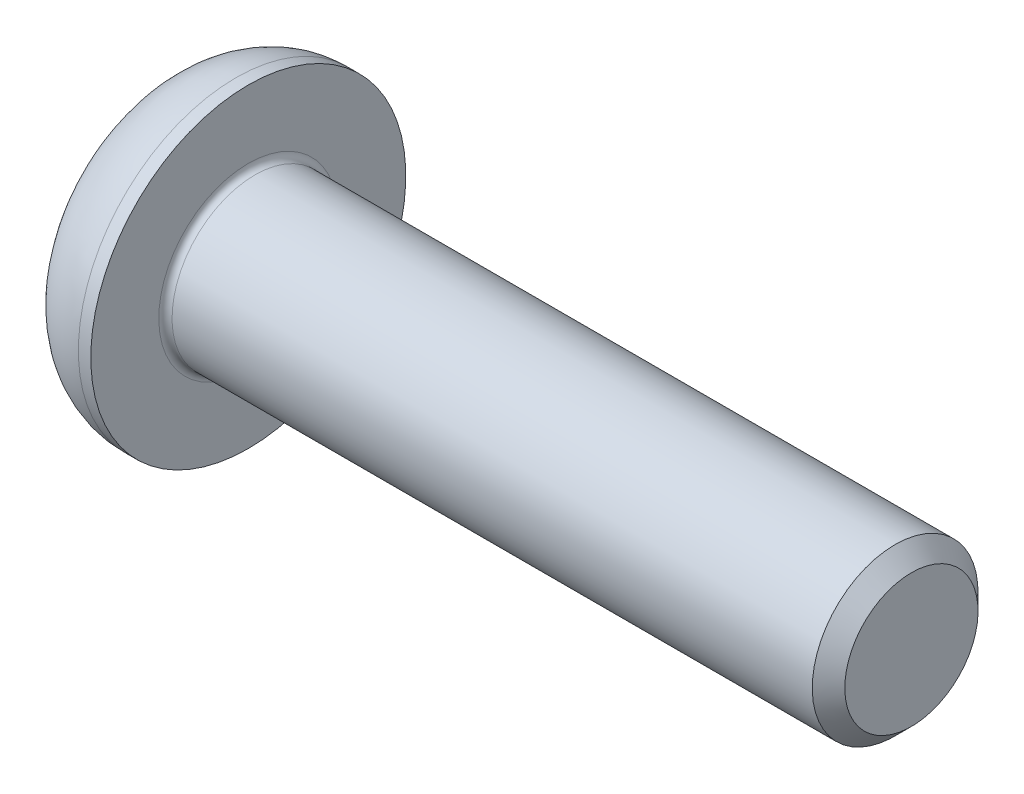
ISO-10303-21;
HEADER;
FILE_DESCRIPTION(('STEP AP214'),'2;1');
FILE_NAME('part.step','',(''),(''),'','','');
FILE_SCHEMA(('AUTOMOTIVE_DESIGN { 1 0 10303 214 1 1 1 1 }'));
ENDSEC;
DATA;
#1=APPLICATION_CONTEXT('core data for automotive mechanical design processes');
#2=APPLICATION_PROTOCOL_DEFINITION('international standard','automotive_design',2000,#1);
#3=PRODUCT_CONTEXT('',#1,'mechanical');
#4=PRODUCT('Part','Part','',(#3));
#5=PRODUCT_RELATED_PRODUCT_CATEGORY('part','',(#4));
#6=PRODUCT_DEFINITION_FORMATION('','',#4);
#7=PRODUCT_DEFINITION_CONTEXT('part definition',#1,'design');
#8=PRODUCT_DEFINITION('design','',#6,#7);
#9=PRODUCT_DEFINITION_SHAPE('','',#8);
#10=(LENGTH_UNIT() NAMED_UNIT(*) SI_UNIT(.MILLI.,.METRE.));
#11=(NAMED_UNIT(*) PLANE_ANGLE_UNIT() SI_UNIT($,.RADIAN.));
#12=(NAMED_UNIT(*) SI_UNIT($,.STERADIAN.) SOLID_ANGLE_UNIT());
#13=UNCERTAINTY_MEASURE_WITH_UNIT(LENGTH_MEASURE(1.E-05),#10,'distance_accuracy_value','');
#14=(GEOMETRIC_REPRESENTATION_CONTEXT(3) GLOBAL_UNCERTAINTY_ASSIGNED_CONTEXT((#13)) GLOBAL_UNIT_ASSIGNED_CONTEXT((#10,
#11,#12)) REPRESENTATION_CONTEXT('',''));
#15=CARTESIAN_POINT('',(0.,0.,0.));
#16=DIRECTION('',(0.,0.,1.));
#17=DIRECTION('',(1.,0.,0.));
#18=AXIS2_PLACEMENT_3D('',#15,#16,#17);
#19=CARTESIAN_POINT('',(0.200000000000002,0.,0.));
#20=DIRECTION('',(1.,0.,0.));
#21=DIRECTION('',(0.,1.,0.));
#22=AXIS2_PLACEMENT_3D('',#19,#20,#21);
#23=TOROIDAL_SURFACE('',#22,2.7,0.2);
#24=CARTESIAN_POINT('',(0.,0.,0.));
#25=DIRECTION('',(1.,0.,0.));
#26=DIRECTION('',(0.,1.,0.));
#27=AXIS2_PLACEMENT_3D('',#24,#25,#26);
#28=CIRCLE('',#27,2.7);
#29=CARTESIAN_POINT('',(0.,2.7,0.));
#30=VERTEX_POINT('',#29);
#31=EDGE_CURVE('E9',#30,#30,#28,.T.);
#32=ORIENTED_EDGE('',*,*,#31,.T.);
#33=EDGE_LOOP('',(#32));
#34=FACE_BOUND('',#33,.T.);
#35=CARTESIAN_POINT('',(0.200000000000002,0.,0.));
#36=DIRECTION('',(-1.,0.,0.));
#37=DIRECTION('',(0.,1.,0.));
#38=AXIS2_PLACEMENT_3D('',#35,#36,#37);
#39=CIRCLE('',#38,2.5);
#40=CARTESIAN_POINT('',(0.200000000000002,2.5,0.));
#41=VERTEX_POINT('',#40);
#42=EDGE_CURVE('E26',#41,#41,#39,.T.);
#43=ORIENTED_EDGE('',*,*,#42,.T.);
#44=EDGE_LOOP('',(#43));
#45=FACE_BOUND('',#44,.T.);
#46=ADVANCED_FACE('F15',(#34,#45),#23,.F.);
#47=CARTESIAN_POINT('',(10.8,0.,0.));
#48=DIRECTION('',(1.,0.,0.));
#49=DIRECTION('',(0.,1.,0.));
#50=AXIS2_PLACEMENT_3D('',#47,#48,#49);
#51=CYLINDRICAL_SURFACE('',#50,2.5);
#52=CARTESIAN_POINT('',(19.50924,0.,0.));
#53=DIRECTION('',(1.,0.,0.));
#54=DIRECTION('',(0.,1.,0.));
#55=AXIS2_PLACEMENT_3D('',#52,#53,#54);
#56=CIRCLE('',#55,2.5);
#57=CARTESIAN_POINT('',(19.50924,2.5,0.));
#58=VERTEX_POINT('',#57);
#59=EDGE_CURVE('E160',#58,#58,#56,.T.);
#60=ORIENTED_EDGE('',*,*,#59,.F.);
#61=EDGE_LOOP('',(#60));
#62=FACE_BOUND('',#61,.T.);
#63=ORIENTED_EDGE('',*,*,#42,.F.);
#64=EDGE_LOOP('',(#63));
#65=FACE_BOUND('',#64,.T.);
#66=ADVANCED_FACE('F170',(#62,#65),#51,.T.);
#67=CARTESIAN_POINT('',(0.,3.625,0.));
#68=DIRECTION('',(1.,0.,0.));
#69=DIRECTION('',(0.,1.,0.));
#70=AXIS2_PLACEMENT_3D('',#67,#68,#69);
#71=PLANE('',#70);
#72=CARTESIAN_POINT('',(0.,0.,0.));
#73=DIRECTION('',(1.,0.,0.));
#74=DIRECTION('',(0.,1.,0.));
#75=AXIS2_PLACEMENT_3D('',#72,#73,#74);
#76=CIRCLE('',#75,4.75);
#77=CARTESIAN_POINT('',(0.,4.75,0.));
#78=VERTEX_POINT('',#77);
#79=EDGE_CURVE('E161',#78,#78,#76,.T.);
#80=ORIENTED_EDGE('',*,*,#79,.T.);
#81=EDGE_LOOP('',(#80));
#82=FACE_BOUND('',#81,.T.);
#83=ORIENTED_EDGE('',*,*,#31,.F.);
#84=EDGE_LOOP('',(#83));
#85=FACE_BOUND('',#84,.T.);
#86=ADVANCED_FACE('F172',(#82,#85),#71,.T.);
#87=CARTESIAN_POINT('',(19.75462,0.,0.));
#88=DIRECTION('',(-1.,0.,0.));
#89=DIRECTION('',(0.,1.,0.));
#90=AXIS2_PLACEMENT_3D('',#87,#88,#89);
#91=CONICAL_SURFACE('',#90,2.25462,0.785398163397445);
#92=ORIENTED_EDGE('',*,*,#59,.T.);
#93=EDGE_LOOP('',(#92));
#94=FACE_BOUND('',#93,.T.);
#95=CARTESIAN_POINT('',(20.,0.,0.));
#96=DIRECTION('',(-1.,0.,0.));
#97=DIRECTION('',(0.,1.,0.));
#98=AXIS2_PLACEMENT_3D('',#95,#96,#97);
#99=CIRCLE('',#98,2.00924);
#100=CARTESIAN_POINT('',(20.,2.00924,0.));
#101=VERTEX_POINT('',#100);
#102=EDGE_CURVE('E157',#101,#101,#99,.T.);
#103=ORIENTED_EDGE('',*,*,#102,.T.);
#104=EDGE_LOOP('',(#103));
#105=FACE_BOUND('',#104,.T.);
#106=ADVANCED_FACE('F180',(#94,#105),#91,.T.);
#107=CARTESIAN_POINT('',(20.,1.25,0.));
#108=DIRECTION('',(1.,0.,0.));
#109=DIRECTION('',(0.,1.,0.));
#110=AXIS2_PLACEMENT_3D('',#107,#108,#109);
#111=PLANE('',#110);
#112=ORIENTED_EDGE('',*,*,#102,.F.);
#113=EDGE_LOOP('',(#112));
#114=FACE_BOUND('',#113,.T.);
#115=ADVANCED_FACE('F190',(#114),#111,.T.);
#116=CARTESIAN_POINT('',(-0.374999999999994,0.,0.));
#117=DIRECTION('',(1.,0.,0.));
#118=DIRECTION('',(0.,1.,0.));
#119=AXIS2_PLACEMENT_3D('',#116,#117,#118);
#120=TOROIDAL_SURFACE('',#119,2.375,2.375);
#121=CARTESIAN_POINT('',(-2.74999999999999,0.,0.));
#122=DIRECTION('',(1.,0.,0.));
#123=DIRECTION('',(0.,1.,0.));
#124=AXIS2_PLACEMENT_3D('',#121,#122,#123);
#125=CIRCLE('',#124,2.375);
#126=CARTESIAN_POINT('',(-2.74999999999999,2.375,0.));
#127=VERTEX_POINT('',#126);
#128=EDGE_CURVE('E154',#127,#127,#125,.T.);
#129=ORIENTED_EDGE('',*,*,#128,.T.);
#130=EDGE_LOOP('',(#129));
#131=FACE_BOUND('',#130,.T.);
#132=CARTESIAN_POINT('',(-0.374999999999994,0.,0.));
#133=DIRECTION('',(-1.,0.,0.));
#134=DIRECTION('',(0.,1.,0.));
#135=AXIS2_PLACEMENT_3D('',#132,#133,#134);
#136=CIRCLE('',#135,4.75);
#137=CARTESIAN_POINT('',(-0.374999999999994,4.75,0.));
#138=VERTEX_POINT('',#137);
#139=EDGE_CURVE('E151',#138,#138,#136,.T.);
#140=ORIENTED_EDGE('',*,*,#139,.T.);
#141=EDGE_LOOP('',(#140));
#142=FACE_BOUND('',#141,.T.);
#143=ADVANCED_FACE('F204',(#131,#142),#120,.T.);
#144=CARTESIAN_POINT('',(-2.74999999999999,3.24102540378444,0.));
#145=DIRECTION('',(-1.,0.,0.));
#146=DIRECTION('',(0.,-1.,0.));
#147=AXIS2_PLACEMENT_3D('',#144,#145,#146);
#148=PLANE('',#147);
#149=DIRECTION('',(0.,0.,1.));
#150=VECTOR('',#149,1.);
#151=CARTESIAN_POINT('',(-2.74999999999999,1.5,0.433012701892218));
#152=LINE('',#151,#150);
#153=CARTESIAN_POINT('',(-2.74999999999999,1.5,-0.866025403784439));
#154=VERTEX_POINT('',#153);
#155=CARTESIAN_POINT('',(-2.74999999999999,1.5,0.866025403784437));
#156=VERTEX_POINT('',#155);
#157=EDGE_CURVE('E149',#154,#156,#152,.T.);
#158=ORIENTED_EDGE('',*,*,#157,.T.);
#159=DIRECTION('',(0.,-0.866025403784438,0.500000000000001));
#160=VECTOR('',#159,1.);
#161=CARTESIAN_POINT('',(-2.74999999999999,0.375,1.51554445662277));
#162=LINE('',#161,#160);
#163=CARTESIAN_POINT('',(-2.74999999999999,0.,1.73205080756888));
#164=VERTEX_POINT('',#163);
#165=EDGE_CURVE('E38',#156,#164,#162,.T.);
#166=ORIENTED_EDGE('',*,*,#165,.T.);
#167=DIRECTION('',(0.,-0.866025403784439,-0.5));
#168=VECTOR('',#167,1.);
#169=CARTESIAN_POINT('',(-2.74999999999999,-1.125,1.08253175473055));
#170=LINE('',#169,#168);
#171=CARTESIAN_POINT('',(-2.74999999999999,-1.5,0.866025403784439));
#172=VERTEX_POINT('',#171);
#173=EDGE_CURVE('E94',#164,#172,#170,.T.);
#174=ORIENTED_EDGE('',*,*,#173,.T.);
#175=DIRECTION('',(0.,0.,-1.));
#176=VECTOR('',#175,1.);
#177=CARTESIAN_POINT('',(-2.74999999999999,-1.5,-0.433012701892219));
#178=LINE('',#177,#176);
#179=CARTESIAN_POINT('',(-2.74999999999999,-1.5,-0.866025403784438));
#180=VERTEX_POINT('',#179);
#181=EDGE_CURVE('E87',#172,#180,#178,.T.);
#182=ORIENTED_EDGE('',*,*,#181,.T.);
#183=DIRECTION('',(0.,0.866025403784439,-0.5));
#184=VECTOR('',#183,1.);
#185=CARTESIAN_POINT('',(-2.74999999999999,-0.375,-1.51554445662277));
#186=LINE('',#185,#184);
#187=CARTESIAN_POINT('',(-2.74999999999999,0.,-1.73205080756888));
#188=VERTEX_POINT('',#187);
#189=EDGE_CURVE('E143',#180,#188,#186,.T.);
#190=ORIENTED_EDGE('',*,*,#189,.T.);
#191=DIRECTION('',(0.,0.866025403784439,0.5));
#192=VECTOR('',#191,1.);
#193=CARTESIAN_POINT('',(-2.74999999999999,1.125,-1.08253175473055));
#194=LINE('',#193,#192);
#195=EDGE_CURVE('E134',#188,#154,#194,.T.);
#196=ORIENTED_EDGE('',*,*,#195,.T.);
#197=EDGE_LOOP('',(#158,#166,#174,#182,#190,#196));
#198=FACE_BOUND('',#197,.T.);
#199=ORIENTED_EDGE('',*,*,#128,.F.);
#200=EDGE_LOOP('',(#199));
#201=FACE_BOUND('',#200,.T.);
#202=ADVANCED_FACE('F195',(#198,#201),#148,.T.);
#203=CARTESIAN_POINT('',(-1.375,0.,0.));
#204=DIRECTION('',(1.,0.,0.));
#205=DIRECTION('',(0.,1.,0.));
#206=AXIS2_PLACEMENT_3D('',#203,#204,#205);
#207=CYLINDRICAL_SURFACE('',#206,4.75);
#208=ORIENTED_EDGE('',*,*,#79,.F.);
#209=EDGE_LOOP('',(#208));
#210=FACE_BOUND('',#209,.T.);
#211=ORIENTED_EDGE('',*,*,#139,.F.);
#212=EDGE_LOOP('',(#211));
#213=FACE_BOUND('',#212,.T.);
#214=ADVANCED_FACE('F192',(#210,#213),#207,.T.);
#215=CARTESIAN_POINT('',(-2.74999999999999,0.,-1.73205080756888));
#216=DIRECTION('',(0.,-0.5,-0.866025403784439));
#217=DIRECTION('',(0.,0.866025403784439,-0.5));
#218=AXIS2_PLACEMENT_3D('',#215,#216,#217);
#219=PLANE('',#218);
#220=CARTESIAN_POINT('',(-1.18999999999999,0.,-1.73205080756887));
#221=CARTESIAN_POINT('',(-0.939999999999999,-0.750000000000001,-1.29903810567666));
#222=CARTESIAN_POINT('',(-1.18999999999999,-1.49999999999999,-0.866025403784445));
#223=(BOUNDED_CURVE() B_SPLINE_CURVE(2,(#220,#221,#222),.UNSPECIFIED.,.F.,
.F.) B_SPLINE_CURVE_WITH_KNOTS((3,3),(0.,0.175265420711685),
.UNSPECIFIED.) CURVE() GEOMETRIC_REPRESENTATION_ITEM() RATIONAL_B_SPLINE_CURVE((1.,
1.15470053837925,1.)) REPRESENTATION_ITEM(''));
#224=CARTESIAN_POINT('',(-1.19,0.,-1.73205080756888));
#225=VERTEX_POINT('',#224);
#226=CARTESIAN_POINT('',(-1.19,-1.5,-0.866025403784438));
#227=VERTEX_POINT('',#226);
#228=EDGE_CURVE('E78',#225,#227,#223,.T.);
#229=ORIENTED_EDGE('',*,*,#228,.F.);
#230=DIRECTION('',(-1.,0.,0.));
#231=VECTOR('',#230,1.);
#232=CARTESIAN_POINT('',(-1.96999999999999,0.,-1.73205080756888));
#233=LINE('',#232,#231);
#234=EDGE_CURVE('E124',#225,#188,#233,.T.);
#235=ORIENTED_EDGE('',*,*,#234,.T.);
#236=ORIENTED_EDGE('',*,*,#189,.F.);
#237=DIRECTION('',(-1.,0.,0.));
#238=VECTOR('',#237,1.);
#239=CARTESIAN_POINT('',(-1.96999999999999,-1.5,-0.866025403784438));
#240=LINE('',#239,#238);
#241=EDGE_CURVE('E90',#227,#180,#240,.T.);
#242=ORIENTED_EDGE('',*,*,#241,.F.);
#243=EDGE_LOOP('',(#229,#235,#236,#242));
#244=FACE_BOUND('',#243,.T.);
#245=ADVANCED_FACE('F194',(#244),#219,.F.);
#246=CARTESIAN_POINT('',(-2.74999999999999,1.5,-0.866025403784439));
#247=DIRECTION('',(0.,0.5,-0.866025403784439));
#248=DIRECTION('',(0.,0.866025403784439,0.5));
#249=AXIS2_PLACEMENT_3D('',#246,#247,#248);
#250=PLANE('',#249);
#251=CARTESIAN_POINT('',(-1.18999999999999,1.49999999999999,-0.866025403784445));
#252=CARTESIAN_POINT('',(-0.939999999999999,0.75,-1.29903810567666));
#253=CARTESIAN_POINT('',(-1.18999999999999,0.,-1.73205080756887));
#254=(BOUNDED_CURVE() B_SPLINE_CURVE(2,(#251,#252,#253),.UNSPECIFIED.,.F.,
.F.) B_SPLINE_CURVE_WITH_KNOTS((3,3),(0.,0.175265420711685),
.UNSPECIFIED.) CURVE() GEOMETRIC_REPRESENTATION_ITEM() RATIONAL_B_SPLINE_CURVE((1.,
1.15470053837924,1.)) REPRESENTATION_ITEM(''));
#255=CARTESIAN_POINT('',(-1.19,1.5,-0.866025403784441));
#256=VERTEX_POINT('',#255);
#257=EDGE_CURVE('E118',#256,#225,#254,.T.);
#258=ORIENTED_EDGE('',*,*,#257,.F.);
#259=DIRECTION('',(-1.,0.,0.));
#260=VECTOR('',#259,1.);
#261=CARTESIAN_POINT('',(-1.96999999999999,1.5,-0.866025403784441));
#262=LINE('',#261,#260);
#263=EDGE_CURVE('E113',#256,#154,#262,.T.);
#264=ORIENTED_EDGE('',*,*,#263,.T.);
#265=ORIENTED_EDGE('',*,*,#195,.F.);
#266=ORIENTED_EDGE('',*,*,#234,.F.);
#267=EDGE_LOOP('',(#258,#264,#265,#266));
#268=FACE_BOUND('',#267,.T.);
#269=ADVANCED_FACE('F201',(#268),#250,.F.);
#270=CARTESIAN_POINT('',(-2.74999999999999,1.5,0.866025403784437));
#271=DIRECTION('',(0.,1.,0.));
#272=DIRECTION('',(0.,0.,1.));
#273=AXIS2_PLACEMENT_3D('',#270,#271,#272);
#274=PLANE('',#273);
#275=CARTESIAN_POINT('',(-1.18999999999999,1.5,0.866025403784425));
#276=CARTESIAN_POINT('',(-0.939999999999999,1.5,0.));
#277=CARTESIAN_POINT('',(-1.18999999999999,1.5,-0.866025403784428));
#278=(BOUNDED_CURVE() B_SPLINE_CURVE(2,(#275,#276,#277),.UNSPECIFIED.,.F.,
.F.) B_SPLINE_CURVE_WITH_KNOTS((3,3),(0.,0.175265420711685),
.UNSPECIFIED.) CURVE() GEOMETRIC_REPRESENTATION_ITEM() RATIONAL_B_SPLINE_CURVE((1.,
1.15470053837924,1.)) REPRESENTATION_ITEM(''));
#279=CARTESIAN_POINT('',(-1.19,1.5,0.866025403784437));
#280=VERTEX_POINT('',#279);
#281=EDGE_CURVE('E97',#280,#256,#278,.T.);
#282=ORIENTED_EDGE('',*,*,#281,.F.);
#283=DIRECTION('',(-1.,0.,0.));
#284=VECTOR('',#283,1.);
#285=CARTESIAN_POINT('',(-1.96999999999999,1.5,0.866025403784437));
#286=LINE('',#285,#284);
#287=EDGE_CURVE('E107',#280,#156,#286,.T.);
#288=ORIENTED_EDGE('',*,*,#287,.T.);
#289=ORIENTED_EDGE('',*,*,#157,.F.);
#290=ORIENTED_EDGE('',*,*,#263,.F.);
#291=EDGE_LOOP('',(#282,#288,#289,#290));
#292=FACE_BOUND('',#291,.T.);
#293=ADVANCED_FACE('F222',(#292),#274,.F.);
#294=CARTESIAN_POINT('',(-2.74999999999999,0.,1.73205080756888));
#295=DIRECTION('',(0.,0.500000000000001,0.866025403784438));
#296=DIRECTION('',(0.,-0.866025403784438,0.500000000000001));
#297=AXIS2_PLACEMENT_3D('',#294,#295,#296);
#298=PLANE('',#297);
#299=CARTESIAN_POINT('',(-1.18999999999999,0.,1.73205080756887));
#300=CARTESIAN_POINT('',(-0.939999999999998,0.750000000000001,1.29903810567666));
#301=CARTESIAN_POINT('',(-1.18999999999999,1.49999999999999,0.866025403784443));
#302=(BOUNDED_CURVE() B_SPLINE_CURVE(2,(#299,#300,#301),.UNSPECIFIED.,.F.,
.F.) B_SPLINE_CURVE_WITH_KNOTS((3,3),(0.,0.175265420711685),
.UNSPECIFIED.) CURVE() GEOMETRIC_REPRESENTATION_ITEM() RATIONAL_B_SPLINE_CURVE((1.,
1.15470053837924,1.)) REPRESENTATION_ITEM(''));
#303=CARTESIAN_POINT('',(-1.19,0.,1.73205080756888));
#304=VERTEX_POINT('',#303);
#305=EDGE_CURVE('E95',#304,#280,#302,.T.);
#306=ORIENTED_EDGE('',*,*,#305,.F.);
#307=DIRECTION('',(1.,0.,0.));
#308=VECTOR('',#307,1.);
#309=CARTESIAN_POINT('',(-1.96999999999999,0.,1.73205080756888));
#310=LINE('',#309,#308);
#311=EDGE_CURVE('E91',#164,#304,#310,.T.);
#312=ORIENTED_EDGE('',*,*,#311,.F.);
#313=ORIENTED_EDGE('',*,*,#165,.F.);
#314=ORIENTED_EDGE('',*,*,#287,.F.);
#315=EDGE_LOOP('',(#306,#312,#313,#314));
#316=FACE_BOUND('',#315,.T.);
#317=ADVANCED_FACE('F226',(#316),#298,.F.);
#318=CARTESIAN_POINT('',(-2.74999999999999,-1.5,-0.866025403784438));
#319=DIRECTION('',(0.,-1.,0.));
#320=DIRECTION('',(0.,0.,-1.));
#321=AXIS2_PLACEMENT_3D('',#318,#319,#320);
#322=PLANE('',#321);
#323=CARTESIAN_POINT('',(-1.18999999999999,-1.5,-0.866025403784426));
#324=CARTESIAN_POINT('',(-0.939999999999999,-1.5,0.));
#325=CARTESIAN_POINT('',(-1.18999999999999,-1.5,0.866025403784426));
#326=(BOUNDED_CURVE() B_SPLINE_CURVE(2,(#323,#324,#325),.UNSPECIFIED.,.F.,
.F.) B_SPLINE_CURVE_WITH_KNOTS((3,3),(0.,0.175265420711685),
.UNSPECIFIED.) CURVE() GEOMETRIC_REPRESENTATION_ITEM() RATIONAL_B_SPLINE_CURVE((1.,
1.15470053837924,1.)) REPRESENTATION_ITEM(''));
#327=CARTESIAN_POINT('',(-1.19,-1.5,0.866025403784438));
#328=VERTEX_POINT('',#327);
#329=EDGE_CURVE('E73',#227,#328,#326,.T.);
#330=ORIENTED_EDGE('',*,*,#329,.F.);
#331=ORIENTED_EDGE('',*,*,#241,.T.);
#332=ORIENTED_EDGE('',*,*,#181,.F.);
#333=DIRECTION('',(-1.,0.,0.));
#334=VECTOR('',#333,1.);
#335=CARTESIAN_POINT('',(-1.96999999999999,-1.5,0.866025403784438));
#336=LINE('',#335,#334);
#337=EDGE_CURVE('E84',#328,#172,#336,.T.);
#338=ORIENTED_EDGE('',*,*,#337,.F.);
#339=EDGE_LOOP('',(#330,#331,#332,#338));
#340=FACE_BOUND('',#339,.T.);
#341=ADVANCED_FACE('F85',(#340),#322,.F.);
#342=CARTESIAN_POINT('',(-2.74999999999999,-1.5,0.866025403784439));
#343=DIRECTION('',(0.,-0.5,0.866025403784439));
#344=DIRECTION('',(0.,-0.866025403784439,-0.5));
#345=AXIS2_PLACEMENT_3D('',#342,#343,#344);
#346=PLANE('',#345);
#347=CARTESIAN_POINT('',(-1.18999999999999,-1.49999999999999,0.866025403784445));
#348=CARTESIAN_POINT('',(-0.939999999999999,-0.75,1.29903810567666));
#349=CARTESIAN_POINT('',(-1.18999999999999,0.,1.73205080756887));
#350=(BOUNDED_CURVE() B_SPLINE_CURVE(2,(#347,#348,#349),.UNSPECIFIED.,.F.,
.F.) B_SPLINE_CURVE_WITH_KNOTS((3,3),(0.,0.175265420711685),
.UNSPECIFIED.) CURVE() GEOMETRIC_REPRESENTATION_ITEM() RATIONAL_B_SPLINE_CURVE((1.,
1.15470053837925,1.)) REPRESENTATION_ITEM(''));
#351=EDGE_CURVE('E19',#328,#304,#350,.T.);
#352=ORIENTED_EDGE('',*,*,#351,.F.);
#353=ORIENTED_EDGE('',*,*,#337,.T.);
#354=ORIENTED_EDGE('',*,*,#173,.F.);
#355=ORIENTED_EDGE('',*,*,#311,.T.);
#356=EDGE_LOOP('',(#352,#353,#354,#355));
#357=FACE_BOUND('',#356,.T.);
#358=ADVANCED_FACE('F93',(#357),#346,.F.);
#359=CARTESIAN_POINT('',(-0.689999999999995,0.,0.));
#360=DIRECTION('',(-1.,0.,0.));
#361=DIRECTION('',(0.,1.,0.));
#362=AXIS2_PLACEMENT_3D('',#359,#360,#361);
#363=CONICAL_SURFACE('',#362,0.866025403784439,1.0471975511966);
#364=CARTESIAN_POINT('',(-0.189999999999993,0.,0.));
#365=VERTEX_POINT('',#364);
#366=VERTEX_LOOP('',#365);
#367=FACE_BOUND('',#366,.T.);
#368=ORIENTED_EDGE('',*,*,#305,.T.);
#369=ORIENTED_EDGE('',*,*,#281,.T.);
#370=ORIENTED_EDGE('',*,*,#257,.T.);
#371=ORIENTED_EDGE('',*,*,#228,.T.);
#372=ORIENTED_EDGE('',*,*,#329,.T.);
#373=ORIENTED_EDGE('',*,*,#351,.T.);
#374=EDGE_LOOP('',(#368,#369,#370,#371,#372,#373));
#375=FACE_BOUND('',#374,.T.);
#376=ADVANCED_FACE('F17',(#367,#375),#363,.F.);
#377=CLOSED_SHELL('',(#46,#66,#86,#106,#115,#143,#202,#214,#245,#269,#293,#317,#341,#358,#376));
#378=MANIFOLD_SOLID_BREP('B1',#377);
#379=ADVANCED_BREP_SHAPE_REPRESENTATION('',(#18,#378),#14);
#380=SHAPE_DEFINITION_REPRESENTATION(#9,#379);
ENDSEC;
END-ISO-10303-21;
